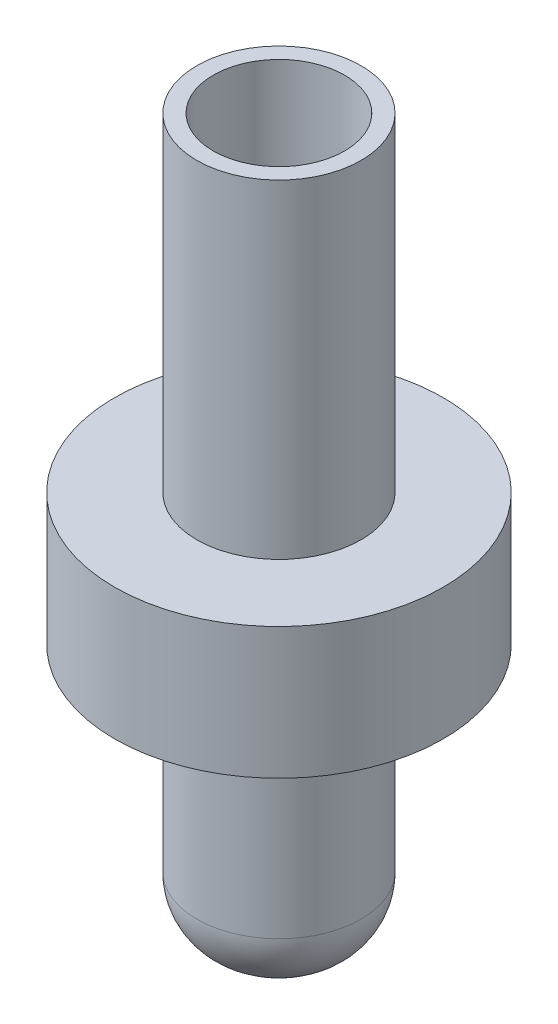
ISO-10303-21;
HEADER;
FILE_DESCRIPTION(('STEP AP214'),'2;1');
FILE_NAME('part.step','',(''),(''),'','','');
FILE_SCHEMA(('AUTOMOTIVE_DESIGN { 1 0 10303 214 1 1 1 1 }'));
ENDSEC;
DATA;
#1=APPLICATION_CONTEXT('core data for automotive mechanical design processes');
#2=APPLICATION_PROTOCOL_DEFINITION('international standard','automotive_design',2000,#1);
#3=PRODUCT_CONTEXT('',#1,'mechanical');
#4=PRODUCT('Part','Part','',(#3));
#5=PRODUCT_RELATED_PRODUCT_CATEGORY('part','',(#4));
#6=PRODUCT_DEFINITION_FORMATION('','',#4);
#7=PRODUCT_DEFINITION_CONTEXT('part definition',#1,'design');
#8=PRODUCT_DEFINITION('design','',#6,#7);
#9=PRODUCT_DEFINITION_SHAPE('','',#8);
#10=(LENGTH_UNIT() NAMED_UNIT(*) SI_UNIT(.MILLI.,.METRE.));
#11=(NAMED_UNIT(*) PLANE_ANGLE_UNIT() SI_UNIT($,.RADIAN.));
#12=(NAMED_UNIT(*) SI_UNIT($,.STERADIAN.) SOLID_ANGLE_UNIT());
#13=UNCERTAINTY_MEASURE_WITH_UNIT(LENGTH_MEASURE(1.E-05),#10,'distance_accuracy_value','');
#14=(GEOMETRIC_REPRESENTATION_CONTEXT(3) GLOBAL_UNCERTAINTY_ASSIGNED_CONTEXT((#13)) GLOBAL_UNIT_ASSIGNED_CONTEXT((#10,
#11,#12)) REPRESENTATION_CONTEXT('',''));
#15=CARTESIAN_POINT('',(0.,0.,0.));
#16=DIRECTION('',(0.,0.,1.));
#17=DIRECTION('',(1.,0.,0.));
#18=AXIS2_PLACEMENT_3D('',#15,#16,#17);
#19=CARTESIAN_POINT('',(0.,4.,0.));
#20=DIRECTION('',(0.,-1.,0.));
#21=DIRECTION('',(0.,0.,-1.));
#22=AXIS2_PLACEMENT_3D('',#19,#20,#21);
#23=CYLINDRICAL_SURFACE('',#22,1.25);
#24=CARTESIAN_POINT('',(0.,1.,0.));
#25=DIRECTION('',(0.,1.,0.));
#26=DIRECTION('',(0.,0.,1.));
#27=AXIS2_PLACEMENT_3D('',#24,#25,#26);
#28=CIRCLE('',#27,1.25);
#29=CARTESIAN_POINT('',(0.,1.,1.25));
#30=VERTEX_POINT('',#29);
#31=EDGE_CURVE('E38',#30,#30,#28,.T.);
#32=ORIENTED_EDGE('',*,*,#31,.T.);
#33=EDGE_LOOP('',(#32));
#34=FACE_BOUND('',#33,.T.);
#35=CARTESIAN_POINT('',(0.,4.,0.));
#36=DIRECTION('',(0.,1.,0.));
#37=DIRECTION('',(0.,0.,1.));
#38=AXIS2_PLACEMENT_3D('',#35,#36,#37);
#39=CIRCLE('',#38,1.25);
#40=CARTESIAN_POINT('',(0.,4.,1.25));
#41=VERTEX_POINT('',#40);
#42=EDGE_CURVE('E46',#41,#41,#39,.T.);
#43=ORIENTED_EDGE('',*,*,#42,.F.);
#44=EDGE_LOOP('',(#43));
#45=FACE_BOUND('',#44,.T.);
#46=ADVANCED_FACE('F31',(#34,#45),#23,.T.);
#47=CARTESIAN_POINT('',(0.,0.,0.));
#48=DIRECTION('',(0.,1.,0.));
#49=DIRECTION('',(0.,0.,1.));
#50=AXIS2_PLACEMENT_3D('',#47,#48,#49);
#51=PLANE('',#50);
#52=CARTESIAN_POINT('',(0.,0.,0.));
#53=DIRECTION('',(0.,1.,0.));
#54=DIRECTION('',(0.,0.,1.));
#55=AXIS2_PLACEMENT_3D('',#52,#53,#54);
#56=CIRCLE('',#55,0.25);
#57=CARTESIAN_POINT('',(0.,0.,0.25));
#58=VERTEX_POINT('',#57);
#59=EDGE_CURVE('E10',#58,#58,#56,.F.);
#60=ORIENTED_EDGE('',*,*,#59,.T.);
#61=EDGE_LOOP('',(#60));
#62=FACE_BOUND('',#61,.T.);
#63=ADVANCED_FACE('F87',(#62),#51,.F.);
#64=CARTESIAN_POINT('',(0.,6.,0.));
#65=DIRECTION('',(0.,-1.,0.));
#66=DIRECTION('',(0.,0.,-1.));
#67=AXIS2_PLACEMENT_3D('',#64,#65,#66);
#68=CYLINDRICAL_SURFACE('',#67,2.5);
#69=CARTESIAN_POINT('',(0.,6.,0.));
#70=DIRECTION('',(0.,1.,0.));
#71=DIRECTION('',(0.,0.,1.));
#72=AXIS2_PLACEMENT_3D('',#69,#70,#71);
#73=CIRCLE('',#72,2.5);
#74=CARTESIAN_POINT('',(0.,6.,2.5));
#75=VERTEX_POINT('',#74);
#76=EDGE_CURVE('E51',#75,#75,#73,.T.);
#77=ORIENTED_EDGE('',*,*,#76,.F.);
#78=EDGE_LOOP('',(#77));
#79=FACE_BOUND('',#78,.T.);
#80=CARTESIAN_POINT('',(0.,4.,0.));
#81=DIRECTION('',(0.,1.,0.));
#82=DIRECTION('',(0.,0.,1.));
#83=AXIS2_PLACEMENT_3D('',#80,#81,#82);
#84=CIRCLE('',#83,2.5);
#85=CARTESIAN_POINT('',(0.,4.,2.5));
#86=VERTEX_POINT('',#85);
#87=EDGE_CURVE('E52',#86,#86,#84,.T.);
#88=ORIENTED_EDGE('',*,*,#87,.T.);
#89=EDGE_LOOP('',(#88));
#90=FACE_BOUND('',#89,.T.);
#91=ADVANCED_FACE('F91',(#79,#90),#68,.T.);
#92=CARTESIAN_POINT('',(0.,6.,0.));
#93=DIRECTION('',(0.,1.,0.));
#94=DIRECTION('',(0.,0.,1.));
#95=AXIS2_PLACEMENT_3D('',#92,#93,#94);
#96=PLANE('',#95);
#97=CARTESIAN_POINT('',(0.,6.,0.));
#98=DIRECTION('',(0.,1.,0.));
#99=DIRECTION('',(0.,0.,1.));
#100=AXIS2_PLACEMENT_3D('',#97,#98,#99);
#101=CIRCLE('',#100,1.25);
#102=CARTESIAN_POINT('',(0.,6.,1.25));
#103=VERTEX_POINT('',#102);
#104=EDGE_CURVE('E58',#103,#103,#101,.T.);
#105=ORIENTED_EDGE('',*,*,#104,.F.);
#106=EDGE_LOOP('',(#105));
#107=FACE_BOUND('',#106,.T.);
#108=ORIENTED_EDGE('',*,*,#76,.T.);
#109=EDGE_LOOP('',(#108));
#110=FACE_BOUND('',#109,.T.);
#111=ADVANCED_FACE('F82',(#107,#110),#96,.T.);
#112=CARTESIAN_POINT('',(0.,4.,0.));
#113=DIRECTION('',(0.,1.,0.));
#114=DIRECTION('',(0.,0.,1.));
#115=AXIS2_PLACEMENT_3D('',#112,#113,#114);
#116=PLANE('',#115);
#117=ORIENTED_EDGE('',*,*,#42,.T.);
#118=EDGE_LOOP('',(#117));
#119=FACE_BOUND('',#118,.T.);
#120=ORIENTED_EDGE('',*,*,#87,.F.);
#121=EDGE_LOOP('',(#120));
#122=FACE_BOUND('',#121,.T.);
#123=ADVANCED_FACE('F73',(#119,#122),#116,.F.);
#124=CARTESIAN_POINT('',(0.,11.,0.));
#125=DIRECTION('',(0.,1.,0.));
#126=DIRECTION('',(0.,0.,1.));
#127=AXIS2_PLACEMENT_3D('',#124,#125,#126);
#128=PLANE('',#127);
#129=CARTESIAN_POINT('',(0.,11.,0.));
#130=DIRECTION('',(0.,1.,0.));
#131=DIRECTION('',(0.,0.,1.));
#132=AXIS2_PLACEMENT_3D('',#129,#130,#131);
#133=CIRCLE('',#132,1.25);
#134=CARTESIAN_POINT('',(0.,11.,1.25));
#135=VERTEX_POINT('',#134);
#136=EDGE_CURVE('E55',#135,#135,#133,.T.);
#137=ORIENTED_EDGE('',*,*,#136,.T.);
#138=EDGE_LOOP('',(#137));
#139=FACE_BOUND('',#138,.T.);
#140=CARTESIAN_POINT('',(0.,11.,0.));
#141=DIRECTION('',(0.,1.,0.));
#142=DIRECTION('',(0.,0.,1.));
#143=AXIS2_PLACEMENT_3D('',#140,#141,#142);
#144=CIRCLE('',#143,1.);
#145=CARTESIAN_POINT('',(0.,11.,1.));
#146=VERTEX_POINT('',#145);
#147=EDGE_CURVE('E61',#146,#146,#144,.T.);
#148=ORIENTED_EDGE('',*,*,#147,.F.);
#149=EDGE_LOOP('',(#148));
#150=FACE_BOUND('',#149,.T.);
#151=ADVANCED_FACE('F70',(#139,#150),#128,.T.);
#152=CARTESIAN_POINT('',(0.,11.,0.));
#153=DIRECTION('',(0.,-1.,0.));
#154=DIRECTION('',(0.,0.,-1.));
#155=AXIS2_PLACEMENT_3D('',#152,#153,#154);
#156=CYLINDRICAL_SURFACE('',#155,1.25);
#157=ORIENTED_EDGE('',*,*,#136,.F.);
#158=EDGE_LOOP('',(#157));
#159=FACE_BOUND('',#158,.T.);
#160=ORIENTED_EDGE('',*,*,#104,.T.);
#161=EDGE_LOOP('',(#160));
#162=FACE_BOUND('',#161,.T.);
#163=ADVANCED_FACE('F72',(#159,#162),#156,.T.);
#164=CARTESIAN_POINT('',(0.,11.,0.));
#165=DIRECTION('',(0.,-1.,0.));
#166=DIRECTION('',(0.,0.,-1.));
#167=AXIS2_PLACEMENT_3D('',#164,#165,#166);
#168=CYLINDRICAL_SURFACE('',#167,1.);
#169=ORIENTED_EDGE('',*,*,#147,.T.);
#170=EDGE_LOOP('',(#169));
#171=FACE_BOUND('',#170,.T.);
#172=CARTESIAN_POINT('',(0.,6.,0.));
#173=DIRECTION('',(0.,1.,0.));
#174=DIRECTION('',(0.,0.,1.));
#175=AXIS2_PLACEMENT_3D('',#172,#173,#174);
#176=CIRCLE('',#175,1.);
#177=CARTESIAN_POINT('',(0.,6.,1.));
#178=VERTEX_POINT('',#177);
#179=EDGE_CURVE('E42',#178,#178,#176,.F.);
#180=ORIENTED_EDGE('',*,*,#179,.T.);
#181=EDGE_LOOP('',(#180));
#182=FACE_BOUND('',#181,.T.);
#183=ADVANCED_FACE('F67',(#171,#182),#168,.F.);
#184=ORIENTED_EDGE('',*,*,#179,.F.);
#185=EDGE_LOOP('',(#184));
#186=FACE_BOUND('',#185,.T.);
#187=ADVANCED_FACE('F100',(#186),#96,.T.);
#188=CARTESIAN_POINT('',(0.,1.,0.));
#189=DIRECTION('',(0.,1.,0.));
#190=DIRECTION('',(0.,0.,1.));
#191=AXIS2_PLACEMENT_3D('',#188,#189,#190);
#192=DEGENERATE_TOROIDAL_SURFACE('',#191,0.25,1.,.T.);
#193=ORIENTED_EDGE('',*,*,#59,.F.);
#194=EDGE_LOOP('',(#193));
#195=FACE_BOUND('',#194,.T.);
#196=ORIENTED_EDGE('',*,*,#31,.F.);
#197=EDGE_LOOP('',(#196));
#198=FACE_BOUND('',#197,.T.);
#199=ADVANCED_FACE('F33',(#195,#198),#192,.T.);
#200=CLOSED_SHELL('',(#46,#63,#91,#111,#123,#151,#163,#183,#187,#199));
#201=MANIFOLD_SOLID_BREP('B2',#200);
#202=ADVANCED_BREP_SHAPE_REPRESENTATION('',(#18,#201),#14);
#203=SHAPE_DEFINITION_REPRESENTATION(#9,#202);
ENDSEC;
END-ISO-10303-21;
